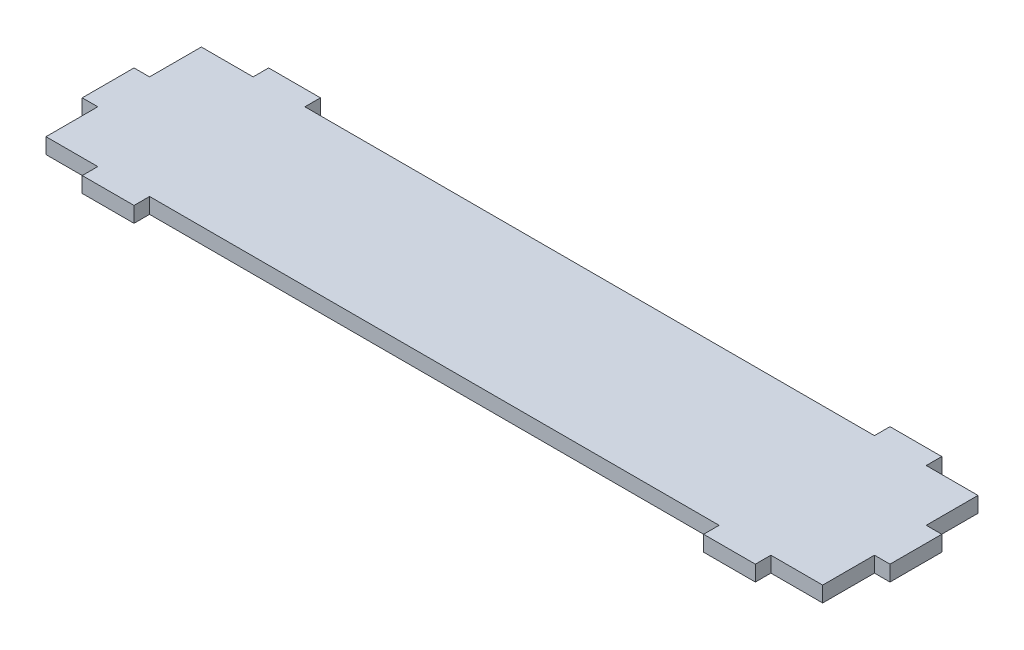
ISO-10303-21;
HEADER;
FILE_DESCRIPTION(('STEP AP214'),'2;1');
FILE_NAME('part.step','',(''),(''),'','','');
FILE_SCHEMA(('AUTOMOTIVE_DESIGN { 1 0 10303 214 1 1 1 1 }'));
ENDSEC;
DATA;
#1=APPLICATION_CONTEXT('core data for automotive mechanical design processes');
#2=APPLICATION_PROTOCOL_DEFINITION('international standard','automotive_design',2000,#1);
#3=PRODUCT_CONTEXT('',#1,'mechanical');
#4=PRODUCT('Part','Part','',(#3));
#5=PRODUCT_RELATED_PRODUCT_CATEGORY('part','',(#4));
#6=PRODUCT_DEFINITION_FORMATION('','',#4);
#7=PRODUCT_DEFINITION_CONTEXT('part definition',#1,'design');
#8=PRODUCT_DEFINITION('design','',#6,#7);
#9=PRODUCT_DEFINITION_SHAPE('','',#8);
#10=(LENGTH_UNIT() NAMED_UNIT(*) SI_UNIT(.MILLI.,.METRE.));
#11=(NAMED_UNIT(*) PLANE_ANGLE_UNIT() SI_UNIT($,.RADIAN.));
#12=(NAMED_UNIT(*) SI_UNIT($,.STERADIAN.) SOLID_ANGLE_UNIT());
#13=UNCERTAINTY_MEASURE_WITH_UNIT(LENGTH_MEASURE(1.E-05),#10,'distance_accuracy_value','');
#14=(GEOMETRIC_REPRESENTATION_CONTEXT(3) GLOBAL_UNCERTAINTY_ASSIGNED_CONTEXT((#13)) GLOBAL_UNIT_ASSIGNED_CONTEXT((#10,
#11,#12)) REPRESENTATION_CONTEXT('',''));
#15=CARTESIAN_POINT('',(0.,0.,0.));
#16=DIRECTION('',(0.,0.,1.));
#17=DIRECTION('',(1.,0.,0.));
#18=AXIS2_PLACEMENT_3D('',#15,#16,#17);
#19=CARTESIAN_POINT('',(-38.1561763334867,3.,-25.9074714975826));
#20=DIRECTION('',(1.,0.,0.));
#21=DIRECTION('',(0.,0.,-1.));
#22=AXIS2_PLACEMENT_3D('',#19,#20,#21);
#23=PLANE('',#22);
#24=DIRECTION('',(0.,0.,1.));
#25=VECTOR('',#24,1.);
#26=CARTESIAN_POINT('',(-38.1561763334867,0.,-25.9074714975826));
#27=LINE('',#26,#25);
#28=CARTESIAN_POINT('',(-38.1561763334867,0.,-25.9074714975826));
#29=VERTEX_POINT('',#28);
#30=CARTESIAN_POINT('',(-38.1561763334867,0.,-15.9074714975826));
#31=VERTEX_POINT('',#30);
#32=EDGE_CURVE('E466',#29,#31,#27,.T.);
#33=ORIENTED_EDGE('',*,*,#32,.T.);
#34=DIRECTION('',(0.,-1.,0.));
#35=VECTOR('',#34,1.);
#36=CARTESIAN_POINT('',(-38.1561763334867,3.,-15.9074714975826));
#37=LINE('',#36,#35);
#38=CARTESIAN_POINT('',(-38.1561763334867,3.,-15.9074714975826));
#39=VERTEX_POINT('',#38);
#40=EDGE_CURVE('E12',#39,#31,#37,.T.);
#41=ORIENTED_EDGE('',*,*,#40,.F.);
#42=DIRECTION('',(0.,0.,1.));
#43=VECTOR('',#42,1.);
#44=CARTESIAN_POINT('',(-38.1561763334867,3.,-25.9074714975826));
#45=LINE('',#44,#43);
#46=CARTESIAN_POINT('',(-38.1561763334867,3.,-25.9074714975826));
#47=VERTEX_POINT('',#46);
#48=EDGE_CURVE('E371',#47,#39,#45,.T.);
#49=ORIENTED_EDGE('',*,*,#48,.F.);
#50=DIRECTION('',(0.,-1.,0.));
#51=VECTOR('',#50,1.);
#52=CARTESIAN_POINT('',(-38.1561763334867,3.,-25.9074714975826));
#53=LINE('',#52,#51);
#54=EDGE_CURVE('E251',#47,#29,#53,.T.);
#55=ORIENTED_EDGE('',*,*,#54,.T.);
#56=EDGE_LOOP('',(#33,#41,#49,#55));
#57=FACE_BOUND('',#56,.T.);
#58=ADVANCED_FACE('F36',(#57),#23,.F.);
#59=CARTESIAN_POINT('',(-38.1561763334867,3.,-15.9074714975826));
#60=DIRECTION('',(0.,0.,1.));
#61=DIRECTION('',(1.,0.,0.));
#62=AXIS2_PLACEMENT_3D('',#59,#60,#61);
#63=PLANE('',#62);
#64=DIRECTION('',(-1.,0.,0.));
#65=VECTOR('',#64,1.);
#66=CARTESIAN_POINT('',(-38.1561763334867,0.,-15.9074714975826));
#67=LINE('',#66,#65);
#68=CARTESIAN_POINT('',(-41.1561763334867,0.,-15.9074714975826));
#69=VERTEX_POINT('',#68);
#70=EDGE_CURVE('E460',#31,#69,#67,.T.);
#71=ORIENTED_EDGE('',*,*,#70,.T.);
#72=DIRECTION('',(0.,-1.,0.));
#73=VECTOR('',#72,1.);
#74=CARTESIAN_POINT('',(-41.1561763334867,3.,-15.9074714975826));
#75=LINE('',#74,#73);
#76=CARTESIAN_POINT('',(-41.1561763334867,3.,-15.9074714975826));
#77=VERTEX_POINT('',#76);
#78=EDGE_CURVE('E44',#77,#69,#75,.T.);
#79=ORIENTED_EDGE('',*,*,#78,.F.);
#80=DIRECTION('',(-1.,0.,0.));
#81=VECTOR('',#80,1.);
#82=CARTESIAN_POINT('',(-38.1561763334867,3.,-15.9074714975826));
#83=LINE('',#82,#81);
#84=EDGE_CURVE('E155',#39,#77,#83,.T.);
#85=ORIENTED_EDGE('',*,*,#84,.F.);
#86=ORIENTED_EDGE('',*,*,#40,.T.);
#87=EDGE_LOOP('',(#71,#79,#85,#86));
#88=FACE_BOUND('',#87,.T.);
#89=ADVANCED_FACE('F527',(#88),#63,.F.);
#90=CARTESIAN_POINT('',(-41.1561763334867,3.,-15.9074714975826));
#91=DIRECTION('',(1.,0.,0.));
#92=DIRECTION('',(0.,0.,-1.));
#93=AXIS2_PLACEMENT_3D('',#90,#91,#92);
#94=PLANE('',#93);
#95=DIRECTION('',(0.,0.,1.));
#96=VECTOR('',#95,1.);
#97=CARTESIAN_POINT('',(-41.1561763334867,0.,-15.9074714975826));
#98=LINE('',#97,#96);
#99=CARTESIAN_POINT('',(-41.1561763334867,0.,-5.90747149758256));
#100=VERTEX_POINT('',#99);
#101=EDGE_CURVE('E455',#69,#100,#98,.T.);
#102=ORIENTED_EDGE('',*,*,#101,.T.);
#103=DIRECTION('',(0.,-1.,0.));
#104=VECTOR('',#103,1.);
#105=CARTESIAN_POINT('',(-41.1561763334867,3.,-5.90747149758256));
#106=LINE('',#105,#104);
#107=CARTESIAN_POINT('',(-41.1561763334867,3.,-5.90747149758256));
#108=VERTEX_POINT('',#107);
#109=EDGE_CURVE('E447',#108,#100,#106,.T.);
#110=ORIENTED_EDGE('',*,*,#109,.F.);
#111=DIRECTION('',(0.,0.,1.));
#112=VECTOR('',#111,1.);
#113=CARTESIAN_POINT('',(-41.1561763334867,3.,-15.9074714975826));
#114=LINE('',#113,#112);
#115=EDGE_CURVE('E363',#77,#108,#114,.T.);
#116=ORIENTED_EDGE('',*,*,#115,.F.);
#117=ORIENTED_EDGE('',*,*,#78,.T.);
#118=EDGE_LOOP('',(#102,#110,#116,#117));
#119=FACE_BOUND('',#118,.T.);
#120=ADVANCED_FACE('F453',(#119),#94,.F.);
#121=CARTESIAN_POINT('',(-38.1561763334867,3.,-5.90747149758257));
#122=DIRECTION('',(0.,0.,-1.));
#123=DIRECTION('',(-1.,0.,0.));
#124=AXIS2_PLACEMENT_3D('',#121,#122,#123);
#125=PLANE('',#124);
#126=DIRECTION('',(1.,0.,0.));
#127=VECTOR('',#126,1.);
#128=CARTESIAN_POINT('',(-38.1561763334867,0.,-5.90747149758257));
#129=LINE('',#128,#127);
#130=CARTESIAN_POINT('',(-38.1561763334867,0.,-5.90747149758257));
#131=VERTEX_POINT('',#130);
#132=EDGE_CURVE('E462',#100,#131,#129,.T.);
#133=ORIENTED_EDGE('',*,*,#132,.T.);
#134=DIRECTION('',(0.,-1.,0.));
#135=VECTOR('',#134,1.);
#136=CARTESIAN_POINT('',(-38.1561763334867,3.,-5.90747149758257));
#137=LINE('',#136,#135);
#138=CARTESIAN_POINT('',(-38.1561763334867,3.,-5.90747149758257));
#139=VERTEX_POINT('',#138);
#140=EDGE_CURVE('E444',#139,#131,#137,.T.);
#141=ORIENTED_EDGE('',*,*,#140,.F.);
#142=DIRECTION('',(1.,0.,0.));
#143=VECTOR('',#142,1.);
#144=CARTESIAN_POINT('',(-38.1561763334867,3.,-5.90747149758257));
#145=LINE('',#144,#143);
#146=EDGE_CURVE('E359',#108,#139,#145,.T.);
#147=ORIENTED_EDGE('',*,*,#146,.F.);
#148=ORIENTED_EDGE('',*,*,#109,.T.);
#149=EDGE_LOOP('',(#133,#141,#147,#148));
#150=FACE_BOUND('',#149,.T.);
#151=ADVANCED_FACE('F534',(#150),#125,.F.);
#152=CARTESIAN_POINT('',(-38.1561763334867,3.,-5.90747149758257));
#153=DIRECTION('',(1.,0.,0.));
#154=DIRECTION('',(0.,0.,-1.));
#155=AXIS2_PLACEMENT_3D('',#152,#153,#154);
#156=PLANE('',#155);
#157=DIRECTION('',(0.,0.,1.));
#158=VECTOR('',#157,1.);
#159=CARTESIAN_POINT('',(-38.1561763334867,0.,-5.90747149758257));
#160=LINE('',#159,#158);
#161=CARTESIAN_POINT('',(-38.1561763334867,0.,4.09252850241743));
#162=VERTEX_POINT('',#161);
#163=EDGE_CURVE('E464',#131,#162,#160,.T.);
#164=ORIENTED_EDGE('',*,*,#163,.T.);
#165=DIRECTION('',(0.,-1.,0.));
#166=VECTOR('',#165,1.);
#167=CARTESIAN_POINT('',(-38.1561763334867,3.,4.09252850241743));
#168=LINE('',#167,#166);
#169=CARTESIAN_POINT('',(-38.1561763334867,3.,4.09252850241743));
#170=VERTEX_POINT('',#169);
#171=EDGE_CURVE('E441',#170,#162,#168,.T.);
#172=ORIENTED_EDGE('',*,*,#171,.F.);
#173=DIRECTION('',(0.,0.,1.));
#174=VECTOR('',#173,1.);
#175=CARTESIAN_POINT('',(-38.1561763334867,3.,-5.90747149758257));
#176=LINE('',#175,#174);
#177=EDGE_CURVE('E356',#139,#170,#176,.T.);
#178=ORIENTED_EDGE('',*,*,#177,.F.);
#179=ORIENTED_EDGE('',*,*,#140,.T.);
#180=EDGE_LOOP('',(#164,#172,#178,#179));
#181=FACE_BOUND('',#180,.T.);
#182=ADVANCED_FACE('F539',(#181),#156,.F.);
#183=CARTESIAN_POINT('',(-38.1561763334867,3.,4.09252850241743));
#184=DIRECTION('',(0.,0.,-1.));
#185=DIRECTION('',(-1.,0.,0.));
#186=AXIS2_PLACEMENT_3D('',#183,#184,#185);
#187=PLANE('',#186);
#188=DIRECTION('',(1.,0.,0.));
#189=VECTOR('',#188,1.);
#190=CARTESIAN_POINT('',(-38.1561763334867,0.,4.09252850241743));
#191=LINE('',#190,#189);
#192=CARTESIAN_POINT('',(-28.1561763334863,0.,4.09252850241744));
#193=VERTEX_POINT('',#192);
#194=EDGE_CURVE('E470',#162,#193,#191,.T.);
#195=ORIENTED_EDGE('',*,*,#194,.T.);
#196=DIRECTION('',(0.,-1.,0.));
#197=VECTOR('',#196,1.);
#198=CARTESIAN_POINT('',(-28.1561763334863,3.,4.09252850241744));
#199=LINE('',#198,#197);
#200=CARTESIAN_POINT('',(-28.1561763334863,3.,4.09252850241744));
#201=VERTEX_POINT('',#200);
#202=EDGE_CURVE('E438',#201,#193,#199,.T.);
#203=ORIENTED_EDGE('',*,*,#202,.F.);
#204=DIRECTION('',(1.,0.,0.));
#205=VECTOR('',#204,1.);
#206=CARTESIAN_POINT('',(-38.1561763334867,3.,4.09252850241743));
#207=LINE('',#206,#205);
#208=EDGE_CURVE('E348',#170,#201,#207,.T.);
#209=ORIENTED_EDGE('',*,*,#208,.F.);
#210=ORIENTED_EDGE('',*,*,#171,.T.);
#211=EDGE_LOOP('',(#195,#203,#209,#210));
#212=FACE_BOUND('',#211,.T.);
#213=ADVANCED_FACE('F543',(#212),#187,.F.);
#214=CARTESIAN_POINT('',(-28.1561763334863,3.,7.09252850241743));
#215=DIRECTION('',(1.,0.,0.));
#216=DIRECTION('',(0.,0.,-1.));
#217=AXIS2_PLACEMENT_3D('',#214,#215,#216);
#218=PLANE('',#217);
#219=DIRECTION('',(0.,0.,1.));
#220=VECTOR('',#219,1.);
#221=CARTESIAN_POINT('',(-28.1561763334863,0.,7.09252850241743));
#222=LINE('',#221,#220);
#223=CARTESIAN_POINT('',(-28.1561763334863,0.,7.09252850241743));
#224=VERTEX_POINT('',#223);
#225=EDGE_CURVE('E472',#193,#224,#222,.T.);
#226=ORIENTED_EDGE('',*,*,#225,.T.);
#227=DIRECTION('',(0.,-1.,0.));
#228=VECTOR('',#227,1.);
#229=CARTESIAN_POINT('',(-28.1561763334863,3.,7.09252850241743));
#230=LINE('',#229,#228);
#231=CARTESIAN_POINT('',(-28.1561763334863,3.,7.09252850241743));
#232=VERTEX_POINT('',#231);
#233=EDGE_CURVE('E435',#232,#224,#230,.T.);
#234=ORIENTED_EDGE('',*,*,#233,.F.);
#235=DIRECTION('',(0.,0.,1.));
#236=VECTOR('',#235,1.);
#237=CARTESIAN_POINT('',(-28.1561763334863,3.,7.09252850241743));
#238=LINE('',#237,#236);
#239=EDGE_CURVE('E344',#201,#232,#238,.T.);
#240=ORIENTED_EDGE('',*,*,#239,.F.);
#241=ORIENTED_EDGE('',*,*,#202,.T.);
#242=EDGE_LOOP('',(#226,#234,#240,#241));
#243=FACE_BOUND('',#242,.T.);
#244=ADVANCED_FACE('F547',(#243),#218,.F.);
#245=CARTESIAN_POINT('',(-28.1561763334863,3.,7.09252850241743));
#246=DIRECTION('',(0.,0.,-1.));
#247=DIRECTION('',(-1.,0.,0.));
#248=AXIS2_PLACEMENT_3D('',#245,#246,#247);
#249=PLANE('',#248);
#250=DIRECTION('',(1.,0.,0.));
#251=VECTOR('',#250,1.);
#252=CARTESIAN_POINT('',(-28.1561763334863,0.,7.09252850241743));
#253=LINE('',#252,#251);
#254=CARTESIAN_POINT('',(-18.1561763334863,0.,7.09252850241743));
#255=VERTEX_POINT('',#254);
#256=EDGE_CURVE('E474',#224,#255,#253,.T.);
#257=ORIENTED_EDGE('',*,*,#256,.T.);
#258=DIRECTION('',(0.,-1.,0.));
#259=VECTOR('',#258,1.);
#260=CARTESIAN_POINT('',(-18.1561763334863,3.,7.09252850241743));
#261=LINE('',#260,#259);
#262=CARTESIAN_POINT('',(-18.1561763334863,3.,7.09252850241743));
#263=VERTEX_POINT('',#262);
#264=EDGE_CURVE('E432',#263,#255,#261,.T.);
#265=ORIENTED_EDGE('',*,*,#264,.F.);
#266=DIRECTION('',(1.,0.,0.));
#267=VECTOR('',#266,1.);
#268=CARTESIAN_POINT('',(-28.1561763334863,3.,7.09252850241743));
#269=LINE('',#268,#267);
#270=EDGE_CURVE('E340',#232,#263,#269,.T.);
#271=ORIENTED_EDGE('',*,*,#270,.F.);
#272=ORIENTED_EDGE('',*,*,#233,.T.);
#273=EDGE_LOOP('',(#257,#265,#271,#272));
#274=FACE_BOUND('',#273,.T.);
#275=ADVANCED_FACE('F551',(#274),#249,.F.);
#276=CARTESIAN_POINT('',(-18.1561763334863,3.,7.09252850241743));
#277=DIRECTION('',(-1.,0.,0.));
#278=DIRECTION('',(0.,0.,1.));
#279=AXIS2_PLACEMENT_3D('',#276,#277,#278);
#280=PLANE('',#279);
#281=DIRECTION('',(0.,0.,-1.));
#282=VECTOR('',#281,1.);
#283=CARTESIAN_POINT('',(-18.1561763334863,0.,7.09252850241743));
#284=LINE('',#283,#282);
#285=CARTESIAN_POINT('',(-18.1561763334863,0.,4.09252850241743));
#286=VERTEX_POINT('',#285);
#287=EDGE_CURVE('E476',#255,#286,#284,.T.);
#288=ORIENTED_EDGE('',*,*,#287,.T.);
#289=DIRECTION('',(0.,-1.,0.));
#290=VECTOR('',#289,1.);
#291=CARTESIAN_POINT('',(-18.1561763334863,3.,4.09252850241743));
#292=LINE('',#291,#290);
#293=CARTESIAN_POINT('',(-18.1561763334863,3.,4.09252850241743));
#294=VERTEX_POINT('',#293);
#295=EDGE_CURVE('E429',#294,#286,#292,.T.);
#296=ORIENTED_EDGE('',*,*,#295,.F.);
#297=DIRECTION('',(0.,0.,-1.));
#298=VECTOR('',#297,1.);
#299=CARTESIAN_POINT('',(-18.1561763334863,3.,7.09252850241743));
#300=LINE('',#299,#298);
#301=EDGE_CURVE('E337',#263,#294,#300,.T.);
#302=ORIENTED_EDGE('',*,*,#301,.F.);
#303=ORIENTED_EDGE('',*,*,#264,.T.);
#304=EDGE_LOOP('',(#288,#296,#302,#303));
#305=FACE_BOUND('',#304,.T.);
#306=ADVANCED_FACE('F555',(#305),#280,.F.);
#307=CARTESIAN_POINT('',(-18.1561763334863,3.,4.09252850241743));
#308=DIRECTION('',(0.,0.,-1.));
#309=DIRECTION('',(-1.,0.,0.));
#310=AXIS2_PLACEMENT_3D('',#307,#308,#309);
#311=PLANE('',#310);
#312=DIRECTION('',(1.,0.,0.));
#313=VECTOR('',#312,1.);
#314=CARTESIAN_POINT('',(-18.1561763334863,0.,4.09252850241743));
#315=LINE('',#314,#313);
#316=CARTESIAN_POINT('',(91.8438236665137,0.,4.09252850241744));
#317=VERTEX_POINT('',#316);
#318=EDGE_CURVE('E478',#286,#317,#315,.T.);
#319=ORIENTED_EDGE('',*,*,#318,.T.);
#320=DIRECTION('',(0.,-1.,0.));
#321=VECTOR('',#320,1.);
#322=CARTESIAN_POINT('',(91.8438236665137,3.,4.09252850241744));
#323=LINE('',#322,#321);
#324=CARTESIAN_POINT('',(91.8438236665137,3.,4.09252850241744));
#325=VERTEX_POINT('',#324);
#326=EDGE_CURVE('E426',#325,#317,#323,.T.);
#327=ORIENTED_EDGE('',*,*,#326,.F.);
#328=DIRECTION('',(1.,0.,0.));
#329=VECTOR('',#328,1.);
#330=CARTESIAN_POINT('',(-18.1561763334863,3.,4.09252850241743));
#331=LINE('',#330,#329);
#332=EDGE_CURVE('E329',#294,#325,#331,.T.);
#333=ORIENTED_EDGE('',*,*,#332,.F.);
#334=ORIENTED_EDGE('',*,*,#295,.T.);
#335=EDGE_LOOP('',(#319,#327,#333,#334));
#336=FACE_BOUND('',#335,.T.);
#337=ADVANCED_FACE('F559',(#336),#311,.F.);
#338=CARTESIAN_POINT('',(91.8438236665137,3.,7.09252850241743));
#339=DIRECTION('',(1.,0.,0.));
#340=DIRECTION('',(0.,0.,-1.));
#341=AXIS2_PLACEMENT_3D('',#338,#339,#340);
#342=PLANE('',#341);
#343=DIRECTION('',(0.,0.,1.));
#344=VECTOR('',#343,1.);
#345=CARTESIAN_POINT('',(91.8438236665137,0.,7.09252850241743));
#346=LINE('',#345,#344);
#347=CARTESIAN_POINT('',(91.8438236665137,0.,7.09252850241743));
#348=VERTEX_POINT('',#347);
#349=EDGE_CURVE('E480',#317,#348,#346,.T.);
#350=ORIENTED_EDGE('',*,*,#349,.T.);
#351=DIRECTION('',(0.,-1.,0.));
#352=VECTOR('',#351,1.);
#353=CARTESIAN_POINT('',(91.8438236665137,3.,7.09252850241743));
#354=LINE('',#353,#352);
#355=CARTESIAN_POINT('',(91.8438236665137,3.,7.09252850241743));
#356=VERTEX_POINT('',#355);
#357=EDGE_CURVE('E423',#356,#348,#354,.T.);
#358=ORIENTED_EDGE('',*,*,#357,.F.);
#359=DIRECTION('',(0.,0.,1.));
#360=VECTOR('',#359,1.);
#361=CARTESIAN_POINT('',(91.8438236665137,3.,7.09252850241743));
#362=LINE('',#361,#360);
#363=EDGE_CURVE('E325',#325,#356,#362,.T.);
#364=ORIENTED_EDGE('',*,*,#363,.F.);
#365=ORIENTED_EDGE('',*,*,#326,.T.);
#366=EDGE_LOOP('',(#350,#358,#364,#365));
#367=FACE_BOUND('',#366,.T.);
#368=ADVANCED_FACE('F563',(#367),#342,.F.);
#369=CARTESIAN_POINT('',(91.8438236665137,3.,7.09252850241743));
#370=DIRECTION('',(0.,0.,-1.));
#371=DIRECTION('',(-1.,0.,0.));
#372=AXIS2_PLACEMENT_3D('',#369,#370,#371);
#373=PLANE('',#372);
#374=DIRECTION('',(1.,0.,0.));
#375=VECTOR('',#374,1.);
#376=CARTESIAN_POINT('',(91.8438236665137,0.,7.09252850241743));
#377=LINE('',#376,#375);
#378=CARTESIAN_POINT('',(101.843823666514,0.,7.09252850241743));
#379=VERTEX_POINT('',#378);
#380=EDGE_CURVE('E482',#348,#379,#377,.T.);
#381=ORIENTED_EDGE('',*,*,#380,.T.);
#382=DIRECTION('',(0.,-1.,0.));
#383=VECTOR('',#382,1.);
#384=CARTESIAN_POINT('',(101.843823666514,3.,7.09252850241743));
#385=LINE('',#384,#383);
#386=CARTESIAN_POINT('',(101.843823666514,3.,7.09252850241743));
#387=VERTEX_POINT('',#386);
#388=EDGE_CURVE('E420',#387,#379,#385,.T.);
#389=ORIENTED_EDGE('',*,*,#388,.F.);
#390=DIRECTION('',(1.,0.,0.));
#391=VECTOR('',#390,1.);
#392=CARTESIAN_POINT('',(91.8438236665137,3.,7.09252850241743));
#393=LINE('',#392,#391);
#394=EDGE_CURVE('E321',#356,#387,#393,.T.);
#395=ORIENTED_EDGE('',*,*,#394,.F.);
#396=ORIENTED_EDGE('',*,*,#357,.T.);
#397=EDGE_LOOP('',(#381,#389,#395,#396));
#398=FACE_BOUND('',#397,.T.);
#399=ADVANCED_FACE('F567',(#398),#373,.F.);
#400=CARTESIAN_POINT('',(101.843823666514,3.,7.09252850241743));
#401=DIRECTION('',(-1.,0.,0.));
#402=DIRECTION('',(0.,0.,1.));
#403=AXIS2_PLACEMENT_3D('',#400,#401,#402);
#404=PLANE('',#403);
#405=DIRECTION('',(0.,0.,-1.));
#406=VECTOR('',#405,1.);
#407=CARTESIAN_POINT('',(101.843823666514,0.,7.09252850241743));
#408=LINE('',#407,#406);
#409=CARTESIAN_POINT('',(101.843823666514,0.,4.09252850241743));
#410=VERTEX_POINT('',#409);
#411=EDGE_CURVE('E484',#379,#410,#408,.T.);
#412=ORIENTED_EDGE('',*,*,#411,.T.);
#413=DIRECTION('',(0.,-1.,0.));
#414=VECTOR('',#413,1.);
#415=CARTESIAN_POINT('',(101.843823666514,3.,4.09252850241743));
#416=LINE('',#415,#414);
#417=CARTESIAN_POINT('',(101.843823666514,3.,4.09252850241743));
#418=VERTEX_POINT('',#417);
#419=EDGE_CURVE('E417',#418,#410,#416,.T.);
#420=ORIENTED_EDGE('',*,*,#419,.F.);
#421=DIRECTION('',(0.,0.,-1.));
#422=VECTOR('',#421,1.);
#423=CARTESIAN_POINT('',(101.843823666514,3.,7.09252850241743));
#424=LINE('',#423,#422);
#425=EDGE_CURVE('E318',#387,#418,#424,.T.);
#426=ORIENTED_EDGE('',*,*,#425,.F.);
#427=ORIENTED_EDGE('',*,*,#388,.T.);
#428=EDGE_LOOP('',(#412,#420,#426,#427));
#429=FACE_BOUND('',#428,.T.);
#430=ADVANCED_FACE('F571',(#429),#404,.F.);
#431=CARTESIAN_POINT('',(101.843823666514,3.,4.09252850241743));
#432=DIRECTION('',(0.,0.,-1.));
#433=DIRECTION('',(-1.,0.,0.));
#434=AXIS2_PLACEMENT_3D('',#431,#432,#433);
#435=PLANE('',#434);
#436=DIRECTION('',(1.,0.,0.));
#437=VECTOR('',#436,1.);
#438=CARTESIAN_POINT('',(101.843823666514,0.,4.09252850241743));
#439=LINE('',#438,#437);
#440=CARTESIAN_POINT('',(111.843823666513,0.,4.09252850241743));
#441=VERTEX_POINT('',#440);
#442=EDGE_CURVE('E486',#410,#441,#439,.T.);
#443=ORIENTED_EDGE('',*,*,#442,.T.);
#444=DIRECTION('',(0.,-1.,0.));
#445=VECTOR('',#444,1.);
#446=CARTESIAN_POINT('',(111.843823666513,3.,4.09252850241743));
#447=LINE('',#446,#445);
#448=CARTESIAN_POINT('',(111.843823666513,3.,4.09252850241743));
#449=VERTEX_POINT('',#448);
#450=EDGE_CURVE('E414',#449,#441,#447,.T.);
#451=ORIENTED_EDGE('',*,*,#450,.F.);
#452=DIRECTION('',(1.,0.,0.));
#453=VECTOR('',#452,1.);
#454=CARTESIAN_POINT('',(101.843823666514,3.,4.09252850241743));
#455=LINE('',#454,#453);
#456=EDGE_CURVE('E310',#418,#449,#455,.T.);
#457=ORIENTED_EDGE('',*,*,#456,.F.);
#458=ORIENTED_EDGE('',*,*,#419,.T.);
#459=EDGE_LOOP('',(#443,#451,#457,#458));
#460=FACE_BOUND('',#459,.T.);
#461=ADVANCED_FACE('F575',(#460),#435,.F.);
#462=CARTESIAN_POINT('',(111.843823666513,3.,-5.90747149758256));
#463=DIRECTION('',(-1.,0.,0.));
#464=DIRECTION('',(0.,0.,1.));
#465=AXIS2_PLACEMENT_3D('',#462,#463,#464);
#466=PLANE('',#465);
#467=DIRECTION('',(0.,0.,-1.));
#468=VECTOR('',#467,1.);
#469=CARTESIAN_POINT('',(111.843823666513,0.,-5.90747149758256));
#470=LINE('',#469,#468);
#471=CARTESIAN_POINT('',(111.843823666513,0.,-5.90747149758256));
#472=VERTEX_POINT('',#471);
#473=EDGE_CURVE('E488',#441,#472,#470,.T.);
#474=ORIENTED_EDGE('',*,*,#473,.T.);
#475=DIRECTION('',(0.,-1.,0.));
#476=VECTOR('',#475,1.);
#477=CARTESIAN_POINT('',(111.843823666513,3.,-5.90747149758256));
#478=LINE('',#477,#476);
#479=CARTESIAN_POINT('',(111.843823666513,3.,-5.90747149758256));
#480=VERTEX_POINT('',#479);
#481=EDGE_CURVE('E411',#480,#472,#478,.T.);
#482=ORIENTED_EDGE('',*,*,#481,.F.);
#483=DIRECTION('',(0.,0.,-1.));
#484=VECTOR('',#483,1.);
#485=CARTESIAN_POINT('',(111.843823666513,3.,-5.90747149758256));
#486=LINE('',#485,#484);
#487=EDGE_CURVE('E306',#449,#480,#486,.T.);
#488=ORIENTED_EDGE('',*,*,#487,.F.);
#489=ORIENTED_EDGE('',*,*,#450,.T.);
#490=EDGE_LOOP('',(#474,#482,#488,#489));
#491=FACE_BOUND('',#490,.T.);
#492=ADVANCED_FACE('F579',(#491),#466,.F.);
#493=CARTESIAN_POINT('',(111.843823666513,3.,-5.90747149758256));
#494=DIRECTION('',(0.,0.,-1.));
#495=DIRECTION('',(-1.,0.,0.));
#496=AXIS2_PLACEMENT_3D('',#493,#494,#495);
#497=PLANE('',#496);
#498=DIRECTION('',(1.,0.,0.));
#499=VECTOR('',#498,1.);
#500=CARTESIAN_POINT('',(111.843823666513,0.,-5.90747149758256));
#501=LINE('',#500,#499);
#502=CARTESIAN_POINT('',(114.843823666513,0.,-5.90747149758256));
#503=VERTEX_POINT('',#502);
#504=EDGE_CURVE('E490',#472,#503,#501,.T.);
#505=ORIENTED_EDGE('',*,*,#504,.T.);
#506=DIRECTION('',(0.,-1.,0.));
#507=VECTOR('',#506,1.);
#508=CARTESIAN_POINT('',(114.843823666513,3.,-5.90747149758256));
#509=LINE('',#508,#507);
#510=CARTESIAN_POINT('',(114.843823666513,3.,-5.90747149758256));
#511=VERTEX_POINT('',#510);
#512=EDGE_CURVE('E408',#511,#503,#509,.T.);
#513=ORIENTED_EDGE('',*,*,#512,.F.);
#514=DIRECTION('',(1.,0.,0.));
#515=VECTOR('',#514,1.);
#516=CARTESIAN_POINT('',(111.843823666513,3.,-5.90747149758256));
#517=LINE('',#516,#515);
#518=EDGE_CURVE('E302',#480,#511,#517,.T.);
#519=ORIENTED_EDGE('',*,*,#518,.F.);
#520=ORIENTED_EDGE('',*,*,#481,.T.);
#521=EDGE_LOOP('',(#505,#513,#519,#520));
#522=FACE_BOUND('',#521,.T.);
#523=ADVANCED_FACE('F583',(#522),#497,.F.);
#524=CARTESIAN_POINT('',(114.843823666513,3.,-15.9074714975826));
#525=DIRECTION('',(-1.,0.,0.));
#526=DIRECTION('',(0.,0.,1.));
#527=AXIS2_PLACEMENT_3D('',#524,#525,#526);
#528=PLANE('',#527);
#529=DIRECTION('',(0.,0.,-1.));
#530=VECTOR('',#529,1.);
#531=CARTESIAN_POINT('',(114.843823666513,0.,-15.9074714975826));
#532=LINE('',#531,#530);
#533=CARTESIAN_POINT('',(114.843823666513,0.,-15.9074714975826));
#534=VERTEX_POINT('',#533);
#535=EDGE_CURVE('E492',#503,#534,#532,.T.);
#536=ORIENTED_EDGE('',*,*,#535,.T.);
#537=DIRECTION('',(0.,-1.,0.));
#538=VECTOR('',#537,1.);
#539=CARTESIAN_POINT('',(114.843823666513,3.,-15.9074714975826));
#540=LINE('',#539,#538);
#541=CARTESIAN_POINT('',(114.843823666513,3.,-15.9074714975826));
#542=VERTEX_POINT('',#541);
#543=EDGE_CURVE('E405',#542,#534,#540,.T.);
#544=ORIENTED_EDGE('',*,*,#543,.F.);
#545=DIRECTION('',(0.,0.,-1.));
#546=VECTOR('',#545,1.);
#547=CARTESIAN_POINT('',(114.843823666513,3.,-15.9074714975826));
#548=LINE('',#547,#546);
#549=EDGE_CURVE('E299',#511,#542,#548,.T.);
#550=ORIENTED_EDGE('',*,*,#549,.F.);
#551=ORIENTED_EDGE('',*,*,#512,.T.);
#552=EDGE_LOOP('',(#536,#544,#550,#551));
#553=FACE_BOUND('',#552,.T.);
#554=ADVANCED_FACE('F587',(#553),#528,.F.);
#555=CARTESIAN_POINT('',(111.843823666513,3.,-15.9074714975826));
#556=DIRECTION('',(0.,0.,1.));
#557=DIRECTION('',(1.,0.,0.));
#558=AXIS2_PLACEMENT_3D('',#555,#556,#557);
#559=PLANE('',#558);
#560=DIRECTION('',(-1.,0.,0.));
#561=VECTOR('',#560,1.);
#562=CARTESIAN_POINT('',(111.843823666513,0.,-15.9074714975826));
#563=LINE('',#562,#561);
#564=CARTESIAN_POINT('',(111.843823666513,0.,-15.9074714975826));
#565=VERTEX_POINT('',#564);
#566=EDGE_CURVE('E494',#534,#565,#563,.T.);
#567=ORIENTED_EDGE('',*,*,#566,.T.);
#568=DIRECTION('',(0.,-1.,0.));
#569=VECTOR('',#568,1.);
#570=CARTESIAN_POINT('',(111.843823666513,3.,-15.9074714975826));
#571=LINE('',#570,#569);
#572=CARTESIAN_POINT('',(111.843823666513,3.,-15.9074714975826));
#573=VERTEX_POINT('',#572);
#574=EDGE_CURVE('E402',#573,#565,#571,.T.);
#575=ORIENTED_EDGE('',*,*,#574,.F.);
#576=DIRECTION('',(-1.,0.,0.));
#577=VECTOR('',#576,1.);
#578=CARTESIAN_POINT('',(111.843823666513,3.,-15.9074714975826));
#579=LINE('',#578,#577);
#580=EDGE_CURVE('E291',#542,#573,#579,.T.);
#581=ORIENTED_EDGE('',*,*,#580,.F.);
#582=ORIENTED_EDGE('',*,*,#543,.T.);
#583=EDGE_LOOP('',(#567,#575,#581,#582));
#584=FACE_BOUND('',#583,.T.);
#585=ADVANCED_FACE('F591',(#584),#559,.F.);
#586=CARTESIAN_POINT('',(111.843823666513,3.,-25.9074714975826));
#587=DIRECTION('',(-1.,0.,0.));
#588=DIRECTION('',(0.,0.,1.));
#589=AXIS2_PLACEMENT_3D('',#586,#587,#588);
#590=PLANE('',#589);
#591=DIRECTION('',(0.,0.,-1.));
#592=VECTOR('',#591,1.);
#593=CARTESIAN_POINT('',(111.843823666513,0.,-25.9074714975826));
#594=LINE('',#593,#592);
#595=CARTESIAN_POINT('',(111.843823666513,0.,-25.9074714975826));
#596=VERTEX_POINT('',#595);
#597=EDGE_CURVE('E496',#565,#596,#594,.T.);
#598=ORIENTED_EDGE('',*,*,#597,.T.);
#599=DIRECTION('',(0.,-1.,0.));
#600=VECTOR('',#599,1.);
#601=CARTESIAN_POINT('',(111.843823666513,3.,-25.9074714975826));
#602=LINE('',#601,#600);
#603=CARTESIAN_POINT('',(111.843823666513,3.,-25.9074714975826));
#604=VERTEX_POINT('',#603);
#605=EDGE_CURVE('E399',#604,#596,#602,.T.);
#606=ORIENTED_EDGE('',*,*,#605,.F.);
#607=DIRECTION('',(0.,0.,-1.));
#608=VECTOR('',#607,1.);
#609=CARTESIAN_POINT('',(111.843823666513,3.,-25.9074714975826));
#610=LINE('',#609,#608);
#611=EDGE_CURVE('E287',#573,#604,#610,.T.);
#612=ORIENTED_EDGE('',*,*,#611,.F.);
#613=ORIENTED_EDGE('',*,*,#574,.T.);
#614=EDGE_LOOP('',(#598,#606,#612,#613));
#615=FACE_BOUND('',#614,.T.);
#616=ADVANCED_FACE('F595',(#615),#590,.F.);
#617=CARTESIAN_POINT('',(101.843823666513,3.,-25.9074714975826));
#618=DIRECTION('',(0.,0.,1.));
#619=DIRECTION('',(1.,0.,0.));
#620=AXIS2_PLACEMENT_3D('',#617,#618,#619);
#621=PLANE('',#620);
#622=DIRECTION('',(-1.,0.,0.));
#623=VECTOR('',#622,1.);
#624=CARTESIAN_POINT('',(101.843823666513,0.,-25.9074714975826));
#625=LINE('',#624,#623);
#626=CARTESIAN_POINT('',(101.843823666513,0.,-25.9074714975826));
#627=VERTEX_POINT('',#626);
#628=EDGE_CURVE('E498',#596,#627,#625,.T.);
#629=ORIENTED_EDGE('',*,*,#628,.T.);
#630=DIRECTION('',(0.,-1.,0.));
#631=VECTOR('',#630,1.);
#632=CARTESIAN_POINT('',(101.843823666513,3.,-25.9074714975826));
#633=LINE('',#632,#631);
#634=CARTESIAN_POINT('',(101.843823666513,3.,-25.9074714975826));
#635=VERTEX_POINT('',#634);
#636=EDGE_CURVE('E396',#635,#627,#633,.T.);
#637=ORIENTED_EDGE('',*,*,#636,.F.);
#638=DIRECTION('',(-1.,0.,0.));
#639=VECTOR('',#638,1.);
#640=CARTESIAN_POINT('',(101.843823666513,3.,-25.9074714975826));
#641=LINE('',#640,#639);
#642=EDGE_CURVE('E283',#604,#635,#641,.T.);
#643=ORIENTED_EDGE('',*,*,#642,.F.);
#644=ORIENTED_EDGE('',*,*,#605,.T.);
#645=EDGE_LOOP('',(#629,#637,#643,#644));
#646=FACE_BOUND('',#645,.T.);
#647=ADVANCED_FACE('F599',(#646),#621,.F.);
#648=CARTESIAN_POINT('',(101.843823666513,3.,-25.9074714975826));
#649=DIRECTION('',(-1.,0.,0.));
#650=DIRECTION('',(0.,0.,1.));
#651=AXIS2_PLACEMENT_3D('',#648,#649,#650);
#652=PLANE('',#651);
#653=DIRECTION('',(0.,0.,-1.));
#654=VECTOR('',#653,1.);
#655=CARTESIAN_POINT('',(101.843823666513,0.,-25.9074714975826));
#656=LINE('',#655,#654);
#657=CARTESIAN_POINT('',(101.843823666513,0.,-28.9074714975826));
#658=VERTEX_POINT('',#657);
#659=EDGE_CURVE('E500',#627,#658,#656,.T.);
#660=ORIENTED_EDGE('',*,*,#659,.T.);
#661=DIRECTION('',(0.,-1.,0.));
#662=VECTOR('',#661,1.);
#663=CARTESIAN_POINT('',(101.843823666513,3.,-28.9074714975826));
#664=LINE('',#663,#662);
#665=CARTESIAN_POINT('',(101.843823666513,3.,-28.9074714975826));
#666=VERTEX_POINT('',#665);
#667=EDGE_CURVE('E393',#666,#658,#664,.T.);
#668=ORIENTED_EDGE('',*,*,#667,.F.);
#669=DIRECTION('',(0.,0.,-1.));
#670=VECTOR('',#669,1.);
#671=CARTESIAN_POINT('',(101.843823666513,3.,-25.9074714975826));
#672=LINE('',#671,#670);
#673=EDGE_CURVE('E280',#635,#666,#672,.T.);
#674=ORIENTED_EDGE('',*,*,#673,.F.);
#675=ORIENTED_EDGE('',*,*,#636,.T.);
#676=EDGE_LOOP('',(#660,#668,#674,#675));
#677=FACE_BOUND('',#676,.T.);
#678=ADVANCED_FACE('F603',(#677),#652,.F.);
#679=CARTESIAN_POINT('',(91.8438236665133,3.,-28.9074714975826));
#680=DIRECTION('',(0.,0.,1.));
#681=DIRECTION('',(1.,0.,0.));
#682=AXIS2_PLACEMENT_3D('',#679,#680,#681);
#683=PLANE('',#682);
#684=DIRECTION('',(-1.,0.,0.));
#685=VECTOR('',#684,1.);
#686=CARTESIAN_POINT('',(91.8438236665133,0.,-28.9074714975826));
#687=LINE('',#686,#685);
#688=CARTESIAN_POINT('',(91.8438236665133,0.,-28.9074714975826));
#689=VERTEX_POINT('',#688);
#690=EDGE_CURVE('E502',#658,#689,#687,.T.);
#691=ORIENTED_EDGE('',*,*,#690,.T.);
#692=DIRECTION('',(0.,-1.,0.));
#693=VECTOR('',#692,1.);
#694=CARTESIAN_POINT('',(91.8438236665133,3.,-28.9074714975826));
#695=LINE('',#694,#693);
#696=CARTESIAN_POINT('',(91.8438236665133,3.,-28.9074714975826));
#697=VERTEX_POINT('',#696);
#698=EDGE_CURVE('E390',#697,#689,#695,.T.);
#699=ORIENTED_EDGE('',*,*,#698,.F.);
#700=DIRECTION('',(-1.,0.,0.));
#701=VECTOR('',#700,1.);
#702=CARTESIAN_POINT('',(91.8438236665133,3.,-28.9074714975826));
#703=LINE('',#702,#701);
#704=EDGE_CURVE('E272',#666,#697,#703,.T.);
#705=ORIENTED_EDGE('',*,*,#704,.F.);
#706=ORIENTED_EDGE('',*,*,#667,.T.);
#707=EDGE_LOOP('',(#691,#699,#705,#706));
#708=FACE_BOUND('',#707,.T.);
#709=ADVANCED_FACE('F607',(#708),#683,.F.);
#710=CARTESIAN_POINT('',(91.8438236665133,3.,-25.9074714975826));
#711=DIRECTION('',(1.,0.,0.));
#712=DIRECTION('',(0.,0.,-1.));
#713=AXIS2_PLACEMENT_3D('',#710,#711,#712);
#714=PLANE('',#713);
#715=DIRECTION('',(0.,0.,1.));
#716=VECTOR('',#715,1.);
#717=CARTESIAN_POINT('',(91.8438236665133,0.,-25.9074714975826));
#718=LINE('',#717,#716);
#719=CARTESIAN_POINT('',(91.8438236665133,0.,-25.9074714975826));
#720=VERTEX_POINT('',#719);
#721=EDGE_CURVE('E504',#689,#720,#718,.T.);
#722=ORIENTED_EDGE('',*,*,#721,.T.);
#723=DIRECTION('',(0.,-1.,0.));
#724=VECTOR('',#723,1.);
#725=CARTESIAN_POINT('',(91.8438236665133,3.,-25.9074714975826));
#726=LINE('',#725,#724);
#727=CARTESIAN_POINT('',(91.8438236665133,3.,-25.9074714975826));
#728=VERTEX_POINT('',#727);
#729=EDGE_CURVE('E387',#728,#720,#726,.T.);
#730=ORIENTED_EDGE('',*,*,#729,.F.);
#731=DIRECTION('',(0.,0.,1.));
#732=VECTOR('',#731,1.);
#733=CARTESIAN_POINT('',(91.8438236665133,3.,-25.9074714975826));
#734=LINE('',#733,#732);
#735=EDGE_CURVE('E268',#697,#728,#734,.T.);
#736=ORIENTED_EDGE('',*,*,#735,.F.);
#737=ORIENTED_EDGE('',*,*,#698,.T.);
#738=EDGE_LOOP('',(#722,#730,#736,#737));
#739=FACE_BOUND('',#738,.T.);
#740=ADVANCED_FACE('F611',(#739),#714,.F.);
#741=CARTESIAN_POINT('',(-18.1561763334867,3.,-25.9074714975826));
#742=DIRECTION('',(0.,0.,1.));
#743=DIRECTION('',(1.,0.,0.));
#744=AXIS2_PLACEMENT_3D('',#741,#742,#743);
#745=PLANE('',#744);
#746=DIRECTION('',(-1.,0.,0.));
#747=VECTOR('',#746,1.);
#748=CARTESIAN_POINT('',(-18.1561763334867,0.,-25.9074714975826));
#749=LINE('',#748,#747);
#750=CARTESIAN_POINT('',(-18.1561763334867,0.,-25.9074714975826));
#751=VERTEX_POINT('',#750);
#752=EDGE_CURVE('E506',#720,#751,#749,.T.);
#753=ORIENTED_EDGE('',*,*,#752,.T.);
#754=DIRECTION('',(0.,-1.,0.));
#755=VECTOR('',#754,1.);
#756=CARTESIAN_POINT('',(-18.1561763334867,3.,-25.9074714975826));
#757=LINE('',#756,#755);
#758=CARTESIAN_POINT('',(-18.1561763334867,3.,-25.9074714975826));
#759=VERTEX_POINT('',#758);
#760=EDGE_CURVE('E384',#759,#751,#757,.T.);
#761=ORIENTED_EDGE('',*,*,#760,.F.);
#762=DIRECTION('',(-1.,0.,0.));
#763=VECTOR('',#762,1.);
#764=CARTESIAN_POINT('',(-18.1561763334867,3.,-25.9074714975826));
#765=LINE('',#764,#763);
#766=EDGE_CURVE('E264',#728,#759,#765,.T.);
#767=ORIENTED_EDGE('',*,*,#766,.F.);
#768=ORIENTED_EDGE('',*,*,#729,.T.);
#769=EDGE_LOOP('',(#753,#761,#767,#768));
#770=FACE_BOUND('',#769,.T.);
#771=ADVANCED_FACE('F615',(#770),#745,.F.);
#772=CARTESIAN_POINT('',(-18.1561763334867,3.,-25.9074714975826));
#773=DIRECTION('',(-1.,0.,0.));
#774=DIRECTION('',(0.,0.,1.));
#775=AXIS2_PLACEMENT_3D('',#772,#773,#774);
#776=PLANE('',#775);
#777=DIRECTION('',(0.,0.,-1.));
#778=VECTOR('',#777,1.);
#779=CARTESIAN_POINT('',(-18.1561763334867,0.,-25.9074714975826));
#780=LINE('',#779,#778);
#781=CARTESIAN_POINT('',(-18.1561763334867,0.,-28.9074714975826));
#782=VERTEX_POINT('',#781);
#783=EDGE_CURVE('E508',#751,#782,#780,.T.);
#784=ORIENTED_EDGE('',*,*,#783,.T.);
#785=DIRECTION('',(0.,-1.,0.));
#786=VECTOR('',#785,1.);
#787=CARTESIAN_POINT('',(-18.1561763334867,3.,-28.9074714975826));
#788=LINE('',#787,#786);
#789=CARTESIAN_POINT('',(-18.1561763334867,3.,-28.9074714975826));
#790=VERTEX_POINT('',#789);
#791=EDGE_CURVE('E244',#790,#782,#788,.T.);
#792=ORIENTED_EDGE('',*,*,#791,.F.);
#793=DIRECTION('',(0.,0.,-1.));
#794=VECTOR('',#793,1.);
#795=CARTESIAN_POINT('',(-18.1561763334867,3.,-25.9074714975826));
#796=LINE('',#795,#794);
#797=EDGE_CURVE('E234',#759,#790,#796,.T.);
#798=ORIENTED_EDGE('',*,*,#797,.F.);
#799=ORIENTED_EDGE('',*,*,#760,.T.);
#800=EDGE_LOOP('',(#784,#792,#798,#799));
#801=FACE_BOUND('',#800,.T.);
#802=ADVANCED_FACE('F511',(#801),#776,.F.);
#803=CARTESIAN_POINT('',(-28.1561763334867,3.,-28.9074714975826));
#804=DIRECTION('',(0.,0.,1.));
#805=DIRECTION('',(1.,0.,0.));
#806=AXIS2_PLACEMENT_3D('',#803,#804,#805);
#807=PLANE('',#806);
#808=DIRECTION('',(-1.,0.,0.));
#809=VECTOR('',#808,1.);
#810=CARTESIAN_POINT('',(-28.1561763334867,0.,-28.9074714975826));
#811=LINE('',#810,#809);
#812=CARTESIAN_POINT('',(-28.1561763334867,0.,-28.9074714975826));
#813=VERTEX_POINT('',#812);
#814=EDGE_CURVE('E243',#782,#813,#811,.T.);
#815=ORIENTED_EDGE('',*,*,#814,.T.);
#816=DIRECTION('',(0.,-1.,0.));
#817=VECTOR('',#816,1.);
#818=CARTESIAN_POINT('',(-28.1561763334867,3.,-28.9074714975826));
#819=LINE('',#818,#817);
#820=CARTESIAN_POINT('',(-28.1561763334867,3.,-28.9074714975826));
#821=VERTEX_POINT('',#820);
#822=EDGE_CURVE('E240',#821,#813,#819,.T.);
#823=ORIENTED_EDGE('',*,*,#822,.F.);
#824=DIRECTION('',(-1.,0.,0.));
#825=VECTOR('',#824,1.);
#826=CARTESIAN_POINT('',(-28.1561763334867,3.,-28.9074714975826));
#827=LINE('',#826,#825);
#828=EDGE_CURVE('E228',#790,#821,#827,.T.);
#829=ORIENTED_EDGE('',*,*,#828,.F.);
#830=ORIENTED_EDGE('',*,*,#791,.T.);
#831=EDGE_LOOP('',(#815,#823,#829,#830));
#832=FACE_BOUND('',#831,.T.);
#833=ADVANCED_FACE('F241',(#832),#807,.F.);
#834=CARTESIAN_POINT('',(-28.1561763334867,3.,-25.9074714975826));
#835=DIRECTION('',(1.,0.,0.));
#836=DIRECTION('',(0.,0.,-1.));
#837=AXIS2_PLACEMENT_3D('',#834,#835,#836);
#838=PLANE('',#837);
#839=DIRECTION('',(0.,0.,1.));
#840=VECTOR('',#839,1.);
#841=CARTESIAN_POINT('',(-28.1561763334867,0.,-25.9074714975826));
#842=LINE('',#841,#840);
#843=CARTESIAN_POINT('',(-28.1561763334867,0.,-25.9074714975826));
#844=VERTEX_POINT('',#843);
#845=EDGE_CURVE('E141',#813,#844,#842,.T.);
#846=ORIENTED_EDGE('',*,*,#845,.T.);
#847=DIRECTION('',(0.,-1.,0.));
#848=VECTOR('',#847,1.);
#849=CARTESIAN_POINT('',(-28.1561763334867,3.,-25.9074714975826));
#850=LINE('',#849,#848);
#851=CARTESIAN_POINT('',(-28.1561763334867,3.,-25.9074714975826));
#852=VERTEX_POINT('',#851);
#853=EDGE_CURVE('E245',#852,#844,#850,.T.);
#854=ORIENTED_EDGE('',*,*,#853,.F.);
#855=DIRECTION('',(0.,0.,1.));
#856=VECTOR('',#855,1.);
#857=CARTESIAN_POINT('',(-28.1561763334867,3.,-25.9074714975826));
#858=LINE('',#857,#856);
#859=EDGE_CURVE('E232',#821,#852,#858,.T.);
#860=ORIENTED_EDGE('',*,*,#859,.F.);
#861=ORIENTED_EDGE('',*,*,#822,.T.);
#862=EDGE_LOOP('',(#846,#854,#860,#861));
#863=FACE_BOUND('',#862,.T.);
#864=ADVANCED_FACE('F247',(#863),#838,.F.);
#865=CARTESIAN_POINT('',(-38.1561763334867,3.,-25.9074714975826));
#866=DIRECTION('',(0.,0.,1.));
#867=DIRECTION('',(1.,0.,0.));
#868=AXIS2_PLACEMENT_3D('',#865,#866,#867);
#869=PLANE('',#868);
#870=DIRECTION('',(-1.,0.,0.));
#871=VECTOR('',#870,1.);
#872=CARTESIAN_POINT('',(-38.1561763334867,0.,-25.9074714975826));
#873=LINE('',#872,#871);
#874=EDGE_CURVE('E147',#844,#29,#873,.T.);
#875=ORIENTED_EDGE('',*,*,#874,.T.);
#876=ORIENTED_EDGE('',*,*,#54,.F.);
#877=DIRECTION('',(-1.,0.,0.));
#878=VECTOR('',#877,1.);
#879=CARTESIAN_POINT('',(-38.1561763334867,3.,-25.9074714975826));
#880=LINE('',#879,#878);
#881=EDGE_CURVE('E52',#852,#47,#880,.T.);
#882=ORIENTED_EDGE('',*,*,#881,.F.);
#883=ORIENTED_EDGE('',*,*,#853,.T.);
#884=EDGE_LOOP('',(#875,#876,#882,#883));
#885=FACE_BOUND('',#884,.T.);
#886=ADVANCED_FACE('F516',(#885),#869,.F.);
#887=CARTESIAN_POINT('',(0.,3.,0.));
#888=DIRECTION('',(0.,-1.,0.));
#889=DIRECTION('',(0.,0.,-1.));
#890=AXIS2_PLACEMENT_3D('',#887,#888,#889);
#891=PLANE('',#890);
#892=ORIENTED_EDGE('',*,*,#48,.T.);
#893=ORIENTED_EDGE('',*,*,#84,.T.);
#894=ORIENTED_EDGE('',*,*,#115,.T.);
#895=ORIENTED_EDGE('',*,*,#146,.T.);
#896=ORIENTED_EDGE('',*,*,#177,.T.);
#897=ORIENTED_EDGE('',*,*,#208,.T.);
#898=ORIENTED_EDGE('',*,*,#239,.T.);
#899=ORIENTED_EDGE('',*,*,#270,.T.);
#900=ORIENTED_EDGE('',*,*,#301,.T.);
#901=ORIENTED_EDGE('',*,*,#332,.T.);
#902=ORIENTED_EDGE('',*,*,#363,.T.);
#903=ORIENTED_EDGE('',*,*,#394,.T.);
#904=ORIENTED_EDGE('',*,*,#425,.T.);
#905=ORIENTED_EDGE('',*,*,#456,.T.);
#906=ORIENTED_EDGE('',*,*,#487,.T.);
#907=ORIENTED_EDGE('',*,*,#518,.T.);
#908=ORIENTED_EDGE('',*,*,#549,.T.);
#909=ORIENTED_EDGE('',*,*,#580,.T.);
#910=ORIENTED_EDGE('',*,*,#611,.T.);
#911=ORIENTED_EDGE('',*,*,#642,.T.);
#912=ORIENTED_EDGE('',*,*,#673,.T.);
#913=ORIENTED_EDGE('',*,*,#704,.T.);
#914=ORIENTED_EDGE('',*,*,#735,.T.);
#915=ORIENTED_EDGE('',*,*,#766,.T.);
#916=ORIENTED_EDGE('',*,*,#797,.T.);
#917=ORIENTED_EDGE('',*,*,#828,.T.);
#918=ORIENTED_EDGE('',*,*,#859,.T.);
#919=ORIENTED_EDGE('',*,*,#881,.T.);
#920=EDGE_LOOP('',(#892,#893,#894,#895,#896,#897,#898,#899,#900,#901,#902,#903,#904,#905,#906,
#907,#908,#909,#910,#911,#912,#913,#914,#915,#916,#917,#918,#919));
#921=FACE_BOUND('',#920,.T.);
#922=ADVANCED_FACE('F230',(#921),#891,.F.);
#923=CARTESIAN_POINT('',(0.,0.,0.));
#924=DIRECTION('',(0.,-1.,0.));
#925=DIRECTION('',(0.,0.,-1.));
#926=AXIS2_PLACEMENT_3D('',#923,#924,#925);
#927=PLANE('',#926);
#928=ORIENTED_EDGE('',*,*,#32,.F.);
#929=ORIENTED_EDGE('',*,*,#874,.F.);
#930=ORIENTED_EDGE('',*,*,#845,.F.);
#931=ORIENTED_EDGE('',*,*,#814,.F.);
#932=ORIENTED_EDGE('',*,*,#783,.F.);
#933=ORIENTED_EDGE('',*,*,#752,.F.);
#934=ORIENTED_EDGE('',*,*,#721,.F.);
#935=ORIENTED_EDGE('',*,*,#690,.F.);
#936=ORIENTED_EDGE('',*,*,#659,.F.);
#937=ORIENTED_EDGE('',*,*,#628,.F.);
#938=ORIENTED_EDGE('',*,*,#597,.F.);
#939=ORIENTED_EDGE('',*,*,#566,.F.);
#940=ORIENTED_EDGE('',*,*,#535,.F.);
#941=ORIENTED_EDGE('',*,*,#504,.F.);
#942=ORIENTED_EDGE('',*,*,#473,.F.);
#943=ORIENTED_EDGE('',*,*,#442,.F.);
#944=ORIENTED_EDGE('',*,*,#411,.F.);
#945=ORIENTED_EDGE('',*,*,#380,.F.);
#946=ORIENTED_EDGE('',*,*,#349,.F.);
#947=ORIENTED_EDGE('',*,*,#318,.F.);
#948=ORIENTED_EDGE('',*,*,#287,.F.);
#949=ORIENTED_EDGE('',*,*,#256,.F.);
#950=ORIENTED_EDGE('',*,*,#225,.F.);
#951=ORIENTED_EDGE('',*,*,#194,.F.);
#952=ORIENTED_EDGE('',*,*,#163,.F.);
#953=ORIENTED_EDGE('',*,*,#132,.F.);
#954=ORIENTED_EDGE('',*,*,#101,.F.);
#955=ORIENTED_EDGE('',*,*,#70,.F.);
#956=EDGE_LOOP('',(#928,#929,#930,#931,#932,#933,#934,#935,#936,#937,#938,#939,#940,#941,#942,
#943,#944,#945,#946,#947,#948,#949,#950,#951,#952,#953,#954,#955));
#957=FACE_BOUND('',#956,.T.);
#958=ADVANCED_FACE('F459',(#957),#927,.T.);
#959=CLOSED_SHELL('',(#58,#89,#120,#151,#182,#213,#244,#275,#306,#337,#368,#399,#430,#461,#492,
#523,#554,#585,#616,#647,#678,#709,#740,#771,#802,#833,#864,#886,#922,#958));
#960=MANIFOLD_SOLID_BREP('B2',#959);
#961=ADVANCED_BREP_SHAPE_REPRESENTATION('',(#18,#960),#14);
#962=SHAPE_DEFINITION_REPRESENTATION(#9,#961);
ENDSEC;
END-ISO-10303-21;
